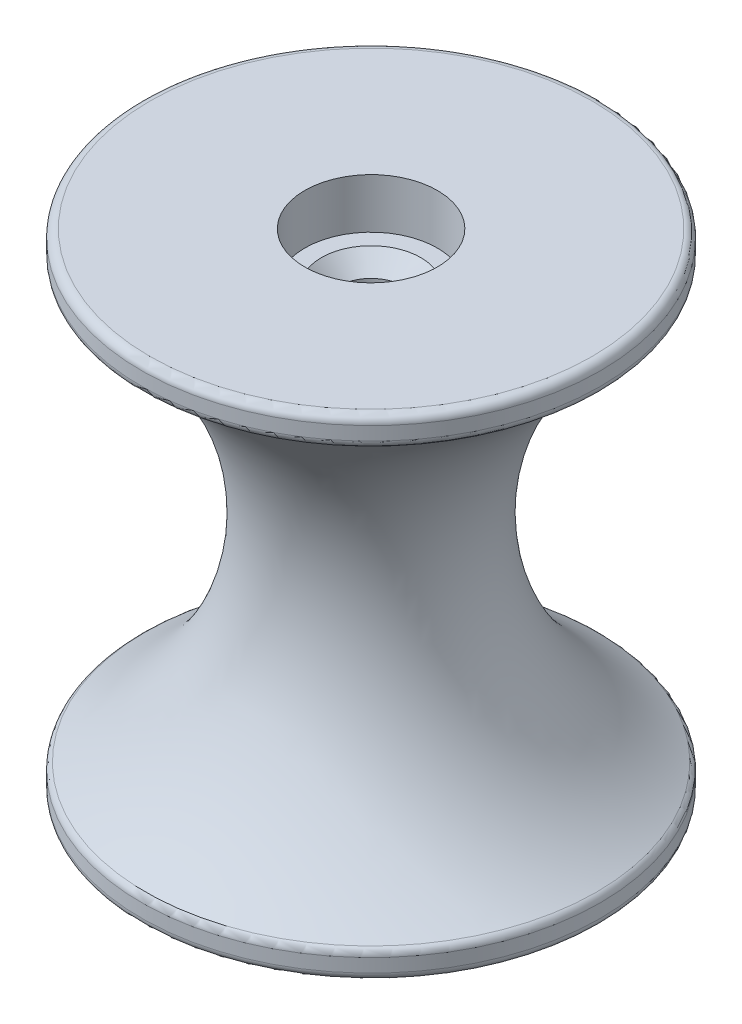
ISO-10303-21;
HEADER;
FILE_DESCRIPTION(('STEP AP214'),'2;1');
FILE_NAME('part.step','',(''),(''),'','','');
FILE_SCHEMA(('AUTOMOTIVE_DESIGN { 1 0 10303 214 1 1 1 1 }'));
ENDSEC;
DATA;
#1=APPLICATION_CONTEXT('core data for automotive mechanical design processes');
#2=APPLICATION_PROTOCOL_DEFINITION('international standard','automotive_design',2000,#1);
#3=PRODUCT_CONTEXT('',#1,'mechanical');
#4=PRODUCT('Part','Part','',(#3));
#5=PRODUCT_RELATED_PRODUCT_CATEGORY('part','',(#4));
#6=PRODUCT_DEFINITION_FORMATION('','',#4);
#7=PRODUCT_DEFINITION_CONTEXT('part definition',#1,'design');
#8=PRODUCT_DEFINITION('design','',#6,#7);
#9=PRODUCT_DEFINITION_SHAPE('','',#8);
#10=(LENGTH_UNIT() NAMED_UNIT(*) SI_UNIT(.MILLI.,.METRE.));
#11=(NAMED_UNIT(*) PLANE_ANGLE_UNIT() SI_UNIT($,.RADIAN.));
#12=(NAMED_UNIT(*) SI_UNIT($,.STERADIAN.) SOLID_ANGLE_UNIT());
#13=UNCERTAINTY_MEASURE_WITH_UNIT(LENGTH_MEASURE(1.E-05),#10,'distance_accuracy_value','');
#14=(GEOMETRIC_REPRESENTATION_CONTEXT(3) GLOBAL_UNCERTAINTY_ASSIGNED_CONTEXT((#13)) GLOBAL_UNIT_ASSIGNED_CONTEXT((#10,
#11,#12)) REPRESENTATION_CONTEXT('',''));
#15=CARTESIAN_POINT('',(0.,0.,0.));
#16=DIRECTION('',(0.,0.,1.));
#17=DIRECTION('',(1.,0.,0.));
#18=AXIS2_PLACEMENT_3D('',#15,#16,#17);
#19=CARTESIAN_POINT('',(0.,0.,0.));
#20=DIRECTION('',(0.,1.,0.));
#21=DIRECTION('',(-1.,0.,0.));
#22=AXIS2_PLACEMENT_3D('',#19,#20,#21);
#23=TOROIDAL_SURFACE('',#22,33.8134225841497,24.0665);
#24=CARTESIAN_POINT('',(0.,20.724789575878,0.));
#25=DIRECTION('',(0.,-1.,0.));
#26=DIRECTION('',(1.,0.,0.));
#27=AXIS2_PLACEMENT_3D('',#24,#25,#26);
#28=CIRCLE('',#27,21.5790644364748);
#29=CARTESIAN_POINT('',(21.5790644364748,20.724789575878,0.));
#30=VERTEX_POINT('',#29);
#31=EDGE_CURVE('E63',#30,#30,#28,.T.);
#32=ORIENTED_EDGE('',*,*,#31,.T.);
#33=EDGE_LOOP('',(#32));
#34=FACE_BOUND('',#33,.T.);
#35=CARTESIAN_POINT('',(0.,-20.7247895758779,0.));
#36=DIRECTION('',(0.,1.,0.));
#37=DIRECTION('',(-1.,0.,0.));
#38=AXIS2_PLACEMENT_3D('',#35,#36,#37);
#39=CIRCLE('',#38,21.5790644364748);
#40=CARTESIAN_POINT('',(-21.5790644364748,-20.724789575878,0.));
#41=VERTEX_POINT('',#40);
#42=EDGE_CURVE('E67',#41,#41,#39,.T.);
#43=ORIENTED_EDGE('',*,*,#42,.T.);
#44=EDGE_LOOP('',(#43));
#45=FACE_BOUND('',#44,.T.);
#46=ADVANCED_FACE('F39',(#34,#45),#23,.F.);
#47=CARTESIAN_POINT('',(0.,23.4902586709,0.));
#48=DIRECTION('',(0.,1.,0.));
#49=DIRECTION('',(-1.,0.,0.));
#50=AXIS2_PLACEMENT_3D('',#47,#48,#49);
#51=CYLINDRICAL_SURFACE('',#50,21.969306582);
#52=CARTESIAN_POINT('',(0.,-21.4083248521272,0.));
#53=DIRECTION('',(0.,-1.,0.));
#54=DIRECTION('',(1.,0.,0.));
#55=AXIS2_PLACEMENT_3D('',#52,#53,#54);
#56=CIRCLE('',#55,21.969306582);
#57=CARTESIAN_POINT('',(21.969306582,-21.4083248521272,0.));
#58=VERTEX_POINT('',#57);
#59=EDGE_CURVE('E52',#58,#58,#56,.T.);
#60=ORIENTED_EDGE('',*,*,#59,.T.);
#61=EDGE_LOOP('',(#60));
#62=FACE_BOUND('',#61,.T.);
#63=CARTESIAN_POINT('',(0.,-22.6965086709,0.));
#64=DIRECTION('',(0.,-1.,0.));
#65=DIRECTION('',(1.,0.,0.));
#66=AXIS2_PLACEMENT_3D('',#63,#64,#65);
#67=CIRCLE('',#66,21.969306582);
#68=CARTESIAN_POINT('',(21.969306582,-22.6965086709,0.));
#69=VERTEX_POINT('',#68);
#70=EDGE_CURVE('E57',#69,#69,#67,.F.);
#71=ORIENTED_EDGE('',*,*,#70,.T.);
#72=EDGE_LOOP('',(#71));
#73=FACE_BOUND('',#72,.T.);
#74=ADVANCED_FACE('F129',(#62,#73),#51,.T.);
#75=CARTESIAN_POINT('',(0.,-23.4902586709,0.));
#76=DIRECTION('',(0.,-1.,0.));
#77=DIRECTION('',(1.,0.,0.));
#78=AXIS2_PLACEMENT_3D('',#75,#76,#77);
#79=PLANE('',#78);
#80=CARTESIAN_POINT('',(0.,-23.4902586709,0.));
#81=DIRECTION('',(0.,-1.,0.));
#82=DIRECTION('',(1.,0.,0.));
#83=AXIS2_PLACEMENT_3D('',#80,#81,#82);
#84=CIRCLE('',#83,21.175556582);
#85=CARTESIAN_POINT('',(21.175556582,-23.4902586709,0.));
#86=VERTEX_POINT('',#85);
#87=EDGE_CURVE('E47',#86,#86,#84,.T.);
#88=ORIENTED_EDGE('',*,*,#87,.T.);
#89=EDGE_LOOP('',(#88));
#90=FACE_BOUND('',#89,.T.);
#91=CARTESIAN_POINT('',(0.,-23.4902586709,0.));
#92=DIRECTION('',(0.,1.,0.));
#93=DIRECTION('',(-1.,0.,0.));
#94=AXIS2_PLACEMENT_3D('',#91,#92,#93);
#95=CIRCLE('',#94,6.35);
#96=CARTESIAN_POINT('',(-6.35,-23.4902586709,0.));
#97=VERTEX_POINT('',#96);
#98=EDGE_CURVE('E79',#97,#97,#95,.T.);
#99=ORIENTED_EDGE('',*,*,#98,.T.);
#100=EDGE_LOOP('',(#99));
#101=FACE_BOUND('',#100,.T.);
#102=ADVANCED_FACE('F135',(#90,#101),#79,.T.);
#103=CARTESIAN_POINT('',(0.,23.4902586709,0.));
#104=DIRECTION('',(0.,1.,0.));
#105=DIRECTION('',(-1.,0.,0.));
#106=AXIS2_PLACEMENT_3D('',#103,#104,#105);
#107=CYLINDRICAL_SURFACE('',#106,6.35);
#108=CARTESIAN_POINT('',(0.,-18.7150586709,0.));
#109=DIRECTION('',(0.,1.,0.));
#110=DIRECTION('',(-1.,0.,0.));
#111=AXIS2_PLACEMENT_3D('',#108,#109,#110);
#112=CIRCLE('',#111,6.35);
#113=CARTESIAN_POINT('',(-6.34999999999999,-18.7150586709,0.));
#114=VERTEX_POINT('',#113);
#115=EDGE_CURVE('E83',#114,#114,#112,.T.);
#116=ORIENTED_EDGE('',*,*,#115,.T.);
#117=EDGE_LOOP('',(#116));
#118=FACE_BOUND('',#117,.T.);
#119=ORIENTED_EDGE('',*,*,#98,.F.);
#120=EDGE_LOOP('',(#119));
#121=FACE_BOUND('',#120,.T.);
#122=ADVANCED_FACE('F198',(#118,#121),#107,.F.);
#123=CARTESIAN_POINT('',(0.,-18.7150586709,0.));
#124=DIRECTION('',(0.,-1.,0.));
#125=DIRECTION('',(1.,0.,0.));
#126=AXIS2_PLACEMENT_3D('',#123,#124,#125);
#127=PLANE('',#126);
#128=CARTESIAN_POINT('',(0.,-18.7150586709,0.));
#129=DIRECTION('',(0.,1.,0.));
#130=DIRECTION('',(-1.,0.,0.));
#131=AXIS2_PLACEMENT_3D('',#128,#129,#130);
#132=CIRCLE('',#131,4.7625);
#133=CARTESIAN_POINT('',(-4.7625,-18.7150586709,0.));
#134=VERTEX_POINT('',#133);
#135=EDGE_CURVE('E87',#134,#134,#132,.T.);
#136=ORIENTED_EDGE('',*,*,#135,.T.);
#137=EDGE_LOOP('',(#136));
#138=FACE_BOUND('',#137,.T.);
#139=ORIENTED_EDGE('',*,*,#115,.F.);
#140=EDGE_LOOP('',(#139));
#141=FACE_BOUND('',#140,.T.);
#142=ADVANCED_FACE('F253',(#138,#141),#127,.T.);
#143=CARTESIAN_POINT('',(0.,-18.7150586709,0.));
#144=DIRECTION('',(0.,-1.,0.));
#145=DIRECTION('',(1.,0.,0.));
#146=AXIS2_PLACEMENT_3D('',#143,#144,#145);
#147=CONICAL_SURFACE('',#146,4.7625,0.785398163397449);
#148=CARTESIAN_POINT('',(0.,-17.1275586709,0.));
#149=DIRECTION('',(0.,1.,0.));
#150=DIRECTION('',(-1.,0.,0.));
#151=AXIS2_PLACEMENT_3D('',#148,#149,#150);
#152=CIRCLE('',#151,3.175);
#153=CARTESIAN_POINT('',(-3.17499999999999,-17.1275586709,0.));
#154=VERTEX_POINT('',#153);
#155=EDGE_CURVE('E91',#154,#154,#152,.T.);
#156=ORIENTED_EDGE('',*,*,#155,.T.);
#157=EDGE_LOOP('',(#156));
#158=FACE_BOUND('',#157,.T.);
#159=ORIENTED_EDGE('',*,*,#135,.F.);
#160=EDGE_LOOP('',(#159));
#161=FACE_BOUND('',#160,.T.);
#162=ADVANCED_FACE('F243',(#158,#161),#147,.F.);
#163=CARTESIAN_POINT('',(0.,23.4902586709,0.));
#164=DIRECTION('',(0.,1.,0.));
#165=DIRECTION('',(-1.,0.,0.));
#166=AXIS2_PLACEMENT_3D('',#163,#164,#165);
#167=CYLINDRICAL_SURFACE('',#166,3.175);
#168=ORIENTED_EDGE('',*,*,#155,.F.);
#169=EDGE_LOOP('',(#168));
#170=FACE_BOUND('',#169,.T.);
#171=CARTESIAN_POINT('',(0.,17.1275586709,0.));
#172=DIRECTION('',(0.,1.,0.));
#173=DIRECTION('',(-1.,0.,0.));
#174=AXIS2_PLACEMENT_3D('',#171,#172,#173);
#175=CIRCLE('',#174,3.175);
#176=CARTESIAN_POINT('',(-3.175,17.1275586709,0.));
#177=VERTEX_POINT('',#176);
#178=EDGE_CURVE('E95',#177,#177,#175,.T.);
#179=ORIENTED_EDGE('',*,*,#178,.T.);
#180=EDGE_LOOP('',(#179));
#181=FACE_BOUND('',#180,.T.);
#182=ADVANCED_FACE('F233',(#170,#181),#167,.F.);
#183=CARTESIAN_POINT('',(0.,18.7150586709,0.));
#184=DIRECTION('',(0.,1.,0.));
#185=DIRECTION('',(-1.,0.,0.));
#186=AXIS2_PLACEMENT_3D('',#183,#184,#185);
#187=CONICAL_SURFACE('',#186,4.7625,0.785398163397449);
#188=ORIENTED_EDGE('',*,*,#178,.F.);
#189=EDGE_LOOP('',(#188));
#190=FACE_BOUND('',#189,.T.);
#191=CARTESIAN_POINT('',(0.,18.7150586709,0.));
#192=DIRECTION('',(0.,1.,0.));
#193=DIRECTION('',(-1.,0.,0.));
#194=AXIS2_PLACEMENT_3D('',#191,#192,#193);
#195=CIRCLE('',#194,4.7625);
#196=CARTESIAN_POINT('',(-4.7625,18.7150586709,0.));
#197=VERTEX_POINT('',#196);
#198=EDGE_CURVE('E99',#197,#197,#195,.T.);
#199=ORIENTED_EDGE('',*,*,#198,.T.);
#200=EDGE_LOOP('',(#199));
#201=FACE_BOUND('',#200,.T.);
#202=ADVANCED_FACE('F223',(#190,#201),#187,.F.);
#203=CARTESIAN_POINT('',(0.,18.7150586709,0.));
#204=DIRECTION('',(0.,-1.,0.));
#205=DIRECTION('',(1.,0.,0.));
#206=AXIS2_PLACEMENT_3D('',#203,#204,#205);
#207=PLANE('',#206);
#208=ORIENTED_EDGE('',*,*,#198,.F.);
#209=EDGE_LOOP('',(#208));
#210=FACE_BOUND('',#209,.T.);
#211=CARTESIAN_POINT('',(0.,18.7150586709,0.));
#212=DIRECTION('',(0.,1.,0.));
#213=DIRECTION('',(-1.,0.,0.));
#214=AXIS2_PLACEMENT_3D('',#211,#212,#213);
#215=CIRCLE('',#214,6.35);
#216=CARTESIAN_POINT('',(-6.35,18.7150586709,0.));
#217=VERTEX_POINT('',#216);
#218=EDGE_CURVE('E103',#217,#217,#215,.T.);
#219=ORIENTED_EDGE('',*,*,#218,.T.);
#220=EDGE_LOOP('',(#219));
#221=FACE_BOUND('',#220,.T.);
#222=ADVANCED_FACE('F125',(#210,#221),#207,.F.);
#223=CARTESIAN_POINT('',(0.,23.4902586709,0.));
#224=DIRECTION('',(0.,1.,0.));
#225=DIRECTION('',(-1.,0.,0.));
#226=AXIS2_PLACEMENT_3D('',#223,#224,#225);
#227=CYLINDRICAL_SURFACE('',#226,6.35);
#228=ORIENTED_EDGE('',*,*,#218,.F.);
#229=EDGE_LOOP('',(#228));
#230=FACE_BOUND('',#229,.T.);
#231=CARTESIAN_POINT('',(0.,23.4902586709,0.));
#232=DIRECTION('',(0.,1.,0.));
#233=DIRECTION('',(-1.,0.,0.));
#234=AXIS2_PLACEMENT_3D('',#231,#232,#233);
#235=CIRCLE('',#234,6.35);
#236=CARTESIAN_POINT('',(-6.35,23.4902586709,0.));
#237=VERTEX_POINT('',#236);
#238=EDGE_CURVE('E107',#237,#237,#235,.T.);
#239=ORIENTED_EDGE('',*,*,#238,.T.);
#240=EDGE_LOOP('',(#239));
#241=FACE_BOUND('',#240,.T.);
#242=ADVANCED_FACE('F112',(#230,#241),#227,.F.);
#243=CARTESIAN_POINT('',(0.,23.4902586709,0.));
#244=DIRECTION('',(0.,-1.,0.));
#245=DIRECTION('',(1.,0.,0.));
#246=AXIS2_PLACEMENT_3D('',#243,#244,#245);
#247=PLANE('',#246);
#248=CARTESIAN_POINT('',(0.,23.4902586709,0.));
#249=DIRECTION('',(0.,-1.,0.));
#250=DIRECTION('',(1.,0.,0.));
#251=AXIS2_PLACEMENT_3D('',#248,#249,#250);
#252=CIRCLE('',#251,21.175556582);
#253=CARTESIAN_POINT('',(21.175556582,23.4902586709,0.));
#254=VERTEX_POINT('',#253);
#255=EDGE_CURVE('E10',#254,#254,#252,.F.);
#256=ORIENTED_EDGE('',*,*,#255,.T.);
#257=EDGE_LOOP('',(#256));
#258=FACE_BOUND('',#257,.T.);
#259=ORIENTED_EDGE('',*,*,#238,.F.);
#260=EDGE_LOOP('',(#259));
#261=FACE_BOUND('',#260,.T.);
#262=ADVANCED_FACE('F114',(#258,#261),#247,.F.);
#263=CARTESIAN_POINT('',(0.,23.4902586709,0.));
#264=DIRECTION('',(0.,1.,0.));
#265=DIRECTION('',(-1.,0.,0.));
#266=AXIS2_PLACEMENT_3D('',#263,#264,#265);
#267=CYLINDRICAL_SURFACE('',#266,21.969306582);
#268=CARTESIAN_POINT('',(0.,21.4083248521272,0.));
#269=DIRECTION('',(0.,-1.,0.));
#270=DIRECTION('',(1.,0.,0.));
#271=AXIS2_PLACEMENT_3D('',#268,#269,#270);
#272=CIRCLE('',#271,21.969306582);
#273=CARTESIAN_POINT('',(21.969306582,21.4083248521272,0.));
#274=VERTEX_POINT('',#273);
#275=EDGE_CURVE('E71',#274,#274,#272,.F.);
#276=ORIENTED_EDGE('',*,*,#275,.T.);
#277=EDGE_LOOP('',(#276));
#278=FACE_BOUND('',#277,.T.);
#279=CARTESIAN_POINT('',(0.,22.6965086709,0.));
#280=DIRECTION('',(0.,-1.,0.));
#281=DIRECTION('',(1.,0.,0.));
#282=AXIS2_PLACEMENT_3D('',#279,#280,#281);
#283=CIRCLE('',#282,21.969306582);
#284=CARTESIAN_POINT('',(21.969306582,22.6965086709,0.));
#285=VERTEX_POINT('',#284);
#286=EDGE_CURVE('E75',#285,#285,#283,.T.);
#287=ORIENTED_EDGE('',*,*,#286,.T.);
#288=EDGE_LOOP('',(#287));
#289=FACE_BOUND('',#288,.T.);
#290=ADVANCED_FACE('F116',(#278,#289),#267,.T.);
#291=CARTESIAN_POINT('',(0.,21.4083248521272,0.));
#292=DIRECTION('',(0.,-1.,0.));
#293=DIRECTION('',(1.,0.,0.));
#294=AXIS2_PLACEMENT_3D('',#291,#292,#293);
#295=TOROIDAL_SURFACE('',#294,21.175556582,0.79375);
#296=ORIENTED_EDGE('',*,*,#31,.F.);
#297=EDGE_LOOP('',(#296));
#298=FACE_BOUND('',#297,.T.);
#299=ORIENTED_EDGE('',*,*,#275,.F.);
#300=EDGE_LOOP('',(#299));
#301=FACE_BOUND('',#300,.T.);
#302=ADVANCED_FACE('F122',(#298,#301),#295,.T.);
#303=CARTESIAN_POINT('',(0.,-21.4083248521272,0.));
#304=DIRECTION('',(0.,-1.,0.));
#305=DIRECTION('',(1.,0.,0.));
#306=AXIS2_PLACEMENT_3D('',#303,#304,#305);
#307=TOROIDAL_SURFACE('',#306,21.175556582,0.79375);
#308=ORIENTED_EDGE('',*,*,#59,.F.);
#309=EDGE_LOOP('',(#308));
#310=FACE_BOUND('',#309,.T.);
#311=ORIENTED_EDGE('',*,*,#42,.F.);
#312=EDGE_LOOP('',(#311));
#313=FACE_BOUND('',#312,.T.);
#314=ADVANCED_FACE('F143',(#310,#313),#307,.T.);
#315=CARTESIAN_POINT('',(0.,-22.6965086709,0.));
#316=DIRECTION('',(0.,-1.,0.));
#317=DIRECTION('',(1.,0.,0.));
#318=AXIS2_PLACEMENT_3D('',#315,#316,#317);
#319=TOROIDAL_SURFACE('',#318,21.175556582,0.79375);
#320=ORIENTED_EDGE('',*,*,#87,.F.);
#321=EDGE_LOOP('',(#320));
#322=FACE_BOUND('',#321,.T.);
#323=ORIENTED_EDGE('',*,*,#70,.F.);
#324=EDGE_LOOP('',(#323));
#325=FACE_BOUND('',#324,.T.);
#326=ADVANCED_FACE('F146',(#322,#325),#319,.T.);
#327=CARTESIAN_POINT('',(0.,22.6965086709,0.));
#328=DIRECTION('',(0.,-1.,0.));
#329=DIRECTION('',(1.,0.,0.));
#330=AXIS2_PLACEMENT_3D('',#327,#328,#329);
#331=TOROIDAL_SURFACE('',#330,21.175556582,0.79375);
#332=ORIENTED_EDGE('',*,*,#286,.F.);
#333=EDGE_LOOP('',(#332));
#334=FACE_BOUND('',#333,.T.);
#335=ORIENTED_EDGE('',*,*,#255,.F.);
#336=EDGE_LOOP('',(#335));
#337=FACE_BOUND('',#336,.T.);
#338=ADVANCED_FACE('F41',(#334,#337),#331,.T.);
#339=CLOSED_SHELL('',(#46,#74,#102,#122,#142,#162,#182,#202,#222,#242,#262,#290,#302,#314,#326,#338));
#340=MANIFOLD_SOLID_BREP('B2',#339);
#341=ADVANCED_BREP_SHAPE_REPRESENTATION('',(#18,#340),#14);
#342=SHAPE_DEFINITION_REPRESENTATION(#9,#341);
ENDSEC;
END-ISO-10303-21;
